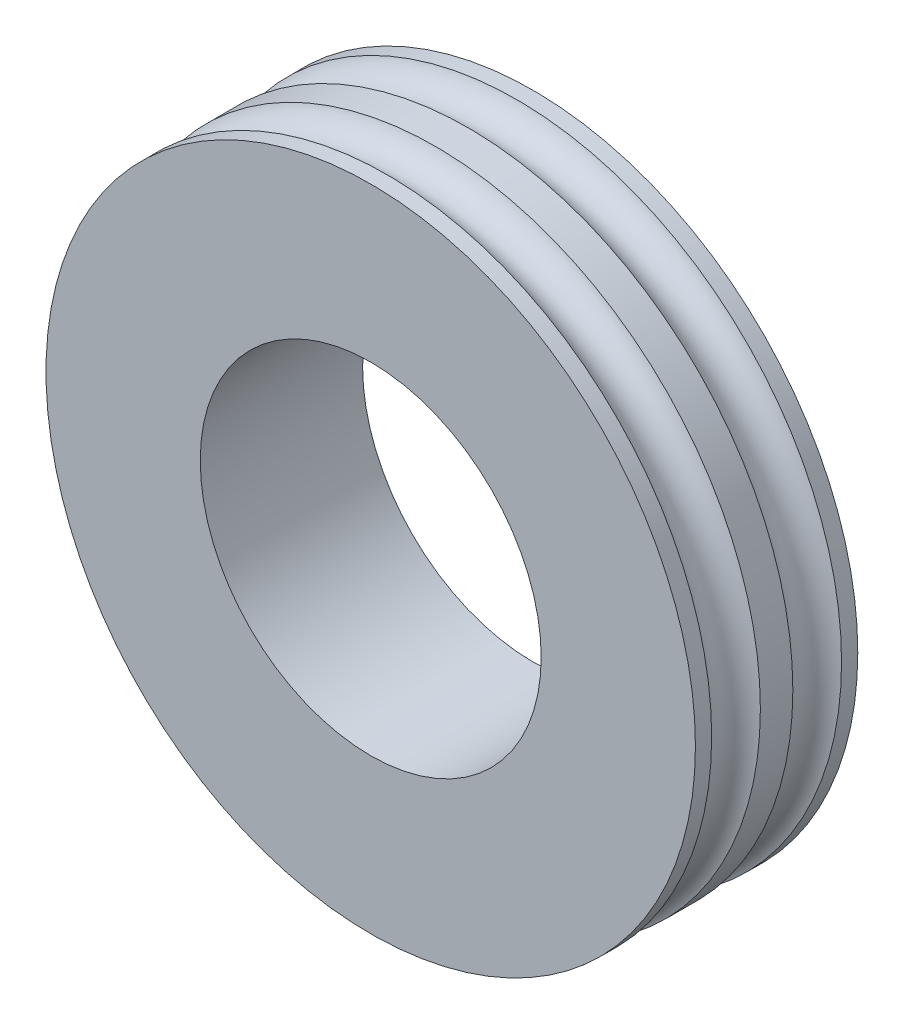
ISO-10303-21;
HEADER;
FILE_DESCRIPTION(('STEP AP214'),'2;1');
FILE_NAME('part.step','',(''),(''),'','','');
FILE_SCHEMA(('AUTOMOTIVE_DESIGN { 1 0 10303 214 1 1 1 1 }'));
ENDSEC;
DATA;
#1=APPLICATION_CONTEXT('core data for automotive mechanical design processes');
#2=APPLICATION_PROTOCOL_DEFINITION('international standard','automotive_design',2000,#1);
#3=PRODUCT_CONTEXT('',#1,'mechanical');
#4=PRODUCT('Part','Part','',(#3));
#5=PRODUCT_RELATED_PRODUCT_CATEGORY('part','',(#4));
#6=PRODUCT_DEFINITION_FORMATION('','',#4);
#7=PRODUCT_DEFINITION_CONTEXT('part definition',#1,'design');
#8=PRODUCT_DEFINITION('design','',#6,#7);
#9=PRODUCT_DEFINITION_SHAPE('','',#8);
#10=(LENGTH_UNIT() NAMED_UNIT(*) SI_UNIT(.MILLI.,.METRE.));
#11=(NAMED_UNIT(*) PLANE_ANGLE_UNIT() SI_UNIT($,.RADIAN.));
#12=(NAMED_UNIT(*) SI_UNIT($,.STERADIAN.) SOLID_ANGLE_UNIT());
#13=UNCERTAINTY_MEASURE_WITH_UNIT(LENGTH_MEASURE(1.E-05),#10,'distance_accuracy_value','');
#14=(GEOMETRIC_REPRESENTATION_CONTEXT(3) GLOBAL_UNCERTAINTY_ASSIGNED_CONTEXT((#13)) GLOBAL_UNIT_ASSIGNED_CONTEXT((#10,
#11,#12)) REPRESENTATION_CONTEXT('',''));
#15=CARTESIAN_POINT('',(0.,0.,0.));
#16=DIRECTION('',(0.,0.,1.));
#17=DIRECTION('',(1.,0.,0.));
#18=AXIS2_PLACEMENT_3D('',#15,#16,#17);
#19=CARTESIAN_POINT('',(0.,0.,3.0146773668033));
#20=DIRECTION('',(0.,0.,1.));
#21=DIRECTION('',(1.,0.,0.));
#22=AXIS2_PLACEMENT_3D('',#19,#20,#21);
#23=CYLINDRICAL_SURFACE('',#22,4.);
#24=CARTESIAN_POINT('',(0.,0.,0.2));
#25=DIRECTION('',(0.,0.,1.));
#26=DIRECTION('',(1.,0.,0.));
#27=AXIS2_PLACEMENT_3D('',#24,#25,#26);
#28=CIRCLE('',#27,4.);
#29=CARTESIAN_POINT('',(4.,0.,0.2));
#30=VERTEX_POINT('',#29);
#31=EDGE_CURVE('E10',#30,#30,#28,.T.);
#32=ORIENTED_EDGE('',*,*,#31,.F.);
#33=EDGE_LOOP('',(#32));
#34=FACE_BOUND('',#33,.T.);
#35=CARTESIAN_POINT('',(0.,0.,-0.2));
#36=DIRECTION('',(0.,0.,1.));
#37=DIRECTION('',(1.,0.,0.));
#38=AXIS2_PLACEMENT_3D('',#35,#36,#37);
#39=CIRCLE('',#38,4.);
#40=CARTESIAN_POINT('',(4.,0.,-0.2));
#41=VERTEX_POINT('',#40);
#42=EDGE_CURVE('E60',#41,#41,#39,.T.);
#43=ORIENTED_EDGE('',*,*,#42,.T.);
#44=EDGE_LOOP('',(#43));
#45=FACE_BOUND('',#44,.T.);
#46=ADVANCED_FACE('F37',(#34,#45),#23,.T.);
#47=CARTESIAN_POINT('',(0.,0.,0.5));
#48=DIRECTION('',(0.,0.,1.));
#49=DIRECTION('',(1.,0.,0.));
#50=AXIS2_PLACEMENT_3D('',#47,#48,#49);
#51=TOROIDAL_SURFACE('',#50,4.1,0.316227766016838);
#52=CARTESIAN_POINT('',(0.,0.,0.8));
#53=DIRECTION('',(0.,0.,1.));
#54=DIRECTION('',(1.,0.,0.));
#55=AXIS2_PLACEMENT_3D('',#52,#53,#54);
#56=CIRCLE('',#55,4.);
#57=CARTESIAN_POINT('',(4.,0.,0.8));
#58=VERTEX_POINT('',#57);
#59=EDGE_CURVE('E44',#58,#58,#56,.T.);
#60=ORIENTED_EDGE('',*,*,#59,.F.);
#61=EDGE_LOOP('',(#60));
#62=FACE_BOUND('',#61,.T.);
#63=ORIENTED_EDGE('',*,*,#31,.T.);
#64=EDGE_LOOP('',(#63));
#65=FACE_BOUND('',#64,.T.);
#66=ADVANCED_FACE('F97',(#62,#65),#51,.F.);
#67=CARTESIAN_POINT('',(0.,0.,3.0146773668033));
#68=DIRECTION('',(0.,0.,1.));
#69=DIRECTION('',(1.,0.,0.));
#70=AXIS2_PLACEMENT_3D('',#67,#68,#69);
#71=CYLINDRICAL_SURFACE('',#70,4.);
#72=CARTESIAN_POINT('',(0.,0.,1.));
#73=DIRECTION('',(0.,0.,1.));
#74=DIRECTION('',(1.,0.,0.));
#75=AXIS2_PLACEMENT_3D('',#72,#73,#74);
#76=CIRCLE('',#75,4.);
#77=CARTESIAN_POINT('',(4.,0.,1.));
#78=VERTEX_POINT('',#77);
#79=EDGE_CURVE('E49',#78,#78,#76,.T.);
#80=ORIENTED_EDGE('',*,*,#79,.F.);
#81=EDGE_LOOP('',(#80));
#82=FACE_BOUND('',#81,.T.);
#83=ORIENTED_EDGE('',*,*,#59,.T.);
#84=EDGE_LOOP('',(#83));
#85=FACE_BOUND('',#84,.T.);
#86=ADVANCED_FACE('F93',(#82,#85),#71,.T.);
#87=CARTESIAN_POINT('',(0.,4.,1.));
#88=DIRECTION('',(0.,0.,-1.));
#89=DIRECTION('',(-1.,0.,0.));
#90=AXIS2_PLACEMENT_3D('',#87,#88,#89);
#91=PLANE('',#90);
#92=CARTESIAN_POINT('',(0.,0.,0.999999999999999));
#93=DIRECTION('',(0.,0.,1.));
#94=DIRECTION('',(1.,0.,0.));
#95=AXIS2_PLACEMENT_3D('',#92,#93,#94);
#96=CIRCLE('',#95,2.1);
#97=CARTESIAN_POINT('',(2.1,0.,0.999999999999999));
#98=VERTEX_POINT('',#97);
#99=EDGE_CURVE('E54',#98,#98,#96,.T.);
#100=ORIENTED_EDGE('',*,*,#99,.F.);
#101=EDGE_LOOP('',(#100));
#102=FACE_BOUND('',#101,.T.);
#103=ORIENTED_EDGE('',*,*,#79,.T.);
#104=EDGE_LOOP('',(#103));
#105=FACE_BOUND('',#104,.T.);
#106=ADVANCED_FACE('F83',(#102,#105),#91,.F.);
#107=CARTESIAN_POINT('',(0.,0.,3.0146773668033));
#108=DIRECTION('',(0.,0.,1.));
#109=DIRECTION('',(1.,0.,0.));
#110=AXIS2_PLACEMENT_3D('',#107,#108,#109);
#111=CYLINDRICAL_SURFACE('',#110,2.1);
#112=ORIENTED_EDGE('',*,*,#99,.T.);
#113=EDGE_LOOP('',(#112));
#114=FACE_BOUND('',#113,.T.);
#115=CARTESIAN_POINT('',(0.,0.,-0.999999999999999));
#116=DIRECTION('',(0.,0.,1.));
#117=DIRECTION('',(1.,0.,0.));
#118=AXIS2_PLACEMENT_3D('',#115,#116,#117);
#119=CIRCLE('',#118,2.1);
#120=CARTESIAN_POINT('',(2.1,0.,-0.999999999999999));
#121=VERTEX_POINT('',#120);
#122=EDGE_CURVE('E72',#121,#121,#119,.T.);
#123=ORIENTED_EDGE('',*,*,#122,.F.);
#124=EDGE_LOOP('',(#123));
#125=FACE_BOUND('',#124,.T.);
#126=ADVANCED_FACE('F80',(#114,#125),#111,.F.);
#127=CARTESIAN_POINT('',(0.,0.,-0.5));
#128=DIRECTION('',(0.,0.,-1.));
#129=DIRECTION('',(1.,0.,0.));
#130=AXIS2_PLACEMENT_3D('',#127,#128,#129);
#131=TOROIDAL_SURFACE('',#130,4.1,0.316227766016838);
#132=CARTESIAN_POINT('',(0.,0.,-0.8));
#133=DIRECTION('',(0.,0.,1.));
#134=DIRECTION('',(1.,0.,0.));
#135=AXIS2_PLACEMENT_3D('',#132,#133,#134);
#136=CIRCLE('',#135,4.);
#137=CARTESIAN_POINT('',(4.,0.,-0.8));
#138=VERTEX_POINT('',#137);
#139=EDGE_CURVE('E64',#138,#138,#136,.T.);
#140=ORIENTED_EDGE('',*,*,#139,.T.);
#141=EDGE_LOOP('',(#140));
#142=FACE_BOUND('',#141,.T.);
#143=ORIENTED_EDGE('',*,*,#42,.F.);
#144=EDGE_LOOP('',(#143));
#145=FACE_BOUND('',#144,.T.);
#146=ADVANCED_FACE('F82',(#142,#145),#131,.F.);
#147=CARTESIAN_POINT('',(0.,0.,-3.0146773668033));
#148=DIRECTION('',(0.,0.,-1.));
#149=DIRECTION('',(1.,0.,0.));
#150=AXIS2_PLACEMENT_3D('',#147,#148,#149);
#151=CYLINDRICAL_SURFACE('',#150,4.);
#152=CARTESIAN_POINT('',(0.,0.,-1.));
#153=DIRECTION('',(0.,0.,1.));
#154=DIRECTION('',(1.,0.,0.));
#155=AXIS2_PLACEMENT_3D('',#152,#153,#154);
#156=CIRCLE('',#155,4.);
#157=CARTESIAN_POINT('',(4.,0.,-1.));
#158=VERTEX_POINT('',#157);
#159=EDGE_CURVE('E68',#158,#158,#156,.T.);
#160=ORIENTED_EDGE('',*,*,#159,.T.);
#161=EDGE_LOOP('',(#160));
#162=FACE_BOUND('',#161,.T.);
#163=ORIENTED_EDGE('',*,*,#139,.F.);
#164=EDGE_LOOP('',(#163));
#165=FACE_BOUND('',#164,.T.);
#166=ADVANCED_FACE('F90',(#162,#165),#151,.T.);
#167=CARTESIAN_POINT('',(0.,4.,-1.));
#168=DIRECTION('',(0.,0.,1.));
#169=DIRECTION('',(-1.,0.,0.));
#170=AXIS2_PLACEMENT_3D('',#167,#168,#169);
#171=PLANE('',#170);
#172=ORIENTED_EDGE('',*,*,#122,.T.);
#173=EDGE_LOOP('',(#172));
#174=FACE_BOUND('',#173,.T.);
#175=ORIENTED_EDGE('',*,*,#159,.F.);
#176=EDGE_LOOP('',(#175));
#177=FACE_BOUND('',#176,.T.);
#178=ADVANCED_FACE('F77',(#174,#177),#171,.F.);
#179=CLOSED_SHELL('',(#46,#66,#86,#106,#126,#146,#166,#178));
#180=MANIFOLD_SOLID_BREP('B2',#179);
#181=ADVANCED_BREP_SHAPE_REPRESENTATION('',(#18,#180),#14);
#182=SHAPE_DEFINITION_REPRESENTATION(#9,#181);
ENDSEC;
END-ISO-10303-21;
